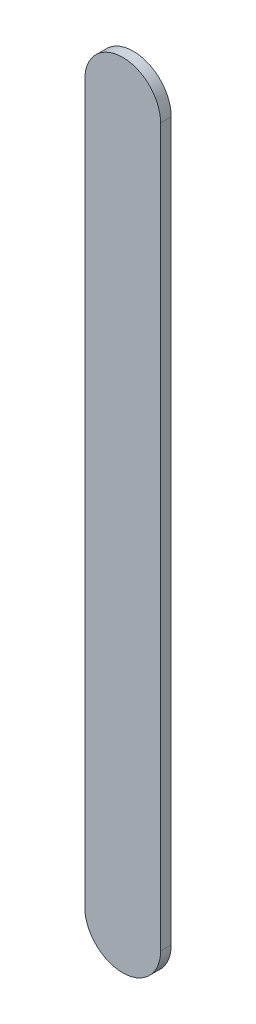
ISO-10303-21;
HEADER;
FILE_DESCRIPTION(('STEP AP214'),'2;1');
FILE_NAME('part.step','',(''),(''),'','','');
FILE_SCHEMA(('AUTOMOTIVE_DESIGN { 1 0 10303 214 1 1 1 1 }'));
ENDSEC;
DATA;
#1=APPLICATION_CONTEXT('core data for automotive mechanical design processes');
#2=APPLICATION_PROTOCOL_DEFINITION('international standard','automotive_design',2000,#1);
#3=PRODUCT_CONTEXT('',#1,'mechanical');
#4=PRODUCT('Part','Part','',(#3));
#5=PRODUCT_RELATED_PRODUCT_CATEGORY('part','',(#4));
#6=PRODUCT_DEFINITION_FORMATION('','',#4);
#7=PRODUCT_DEFINITION_CONTEXT('part definition',#1,'design');
#8=PRODUCT_DEFINITION('design','',#6,#7);
#9=PRODUCT_DEFINITION_SHAPE('','',#8);
#10=(LENGTH_UNIT() NAMED_UNIT(*) SI_UNIT(.MILLI.,.METRE.));
#11=(NAMED_UNIT(*) PLANE_ANGLE_UNIT() SI_UNIT($,.RADIAN.));
#12=(NAMED_UNIT(*) SI_UNIT($,.STERADIAN.) SOLID_ANGLE_UNIT());
#13=UNCERTAINTY_MEASURE_WITH_UNIT(LENGTH_MEASURE(1.E-05),#10,'distance_accuracy_value','');
#14=(GEOMETRIC_REPRESENTATION_CONTEXT(3) GLOBAL_UNCERTAINTY_ASSIGNED_CONTEXT((#13)) GLOBAL_UNIT_ASSIGNED_CONTEXT((#10,
#11,#12)) REPRESENTATION_CONTEXT('',''));
#15=CARTESIAN_POINT('',(0.,0.,0.));
#16=DIRECTION('',(0.,0.,1.));
#17=DIRECTION('',(1.,0.,0.));
#18=AXIS2_PLACEMENT_3D('',#15,#16,#17);
#19=CARTESIAN_POINT('',(87.4440212,97.68692426,0.));
#20=DIRECTION('',(-1.,0.,0.));
#21=DIRECTION('',(0.,1.,0.));
#22=AXIS2_PLACEMENT_3D('',#19,#20,#21);
#23=PLANE('',#22);
#24=DIRECTION('',(0.,1.,0.));
#25=VECTOR('',#24,1.);
#26=CARTESIAN_POINT('',(87.4440212,97.68692426,0.03556));
#27=LINE('',#26,#25);
#28=CARTESIAN_POINT('',(87.4440212,97.68692426,0.03556));
#29=VERTEX_POINT('',#28);
#30=CARTESIAN_POINT('',(87.4440212,100.0900208,0.03556));
#31=VERTEX_POINT('',#30);
#32=EDGE_CURVE('E11',#29,#31,#27,.T.);
#33=ORIENTED_EDGE('',*,*,#32,.F.);
#34=DIRECTION('',(0.,0.,1.));
#35=VECTOR('',#34,1.);
#36=CARTESIAN_POINT('',(87.4440212,97.68692426,0.));
#37=LINE('',#36,#35);
#38=CARTESIAN_POINT('',(87.4440212,97.68692426,0.));
#39=VERTEX_POINT('',#38);
#40=EDGE_CURVE('E24',#39,#29,#37,.T.);
#41=ORIENTED_EDGE('',*,*,#40,.F.);
#42=DIRECTION('',(0.,1.,0.));
#43=VECTOR('',#42,1.);
#44=CARTESIAN_POINT('',(87.4440212,97.68692426,0.));
#45=LINE('',#44,#43);
#46=CARTESIAN_POINT('',(87.4440212,100.0900208,0.));
#47=VERTEX_POINT('',#46);
#48=EDGE_CURVE('E75',#39,#47,#45,.T.);
#49=ORIENTED_EDGE('',*,*,#48,.T.);
#50=DIRECTION('',(0.,0.,1.));
#51=VECTOR('',#50,1.);
#52=CARTESIAN_POINT('',(87.4440212,100.0900208,0.));
#53=LINE('',#52,#51);
#54=EDGE_CURVE('E37',#47,#31,#53,.T.);
#55=ORIENTED_EDGE('',*,*,#54,.T.);
#56=EDGE_LOOP('',(#33,#41,#49,#55));
#57=FACE_BOUND('',#56,.T.);
#58=ADVANCED_FACE('F17',(#57),#23,.F.);
#59=CARTESIAN_POINT('',(87.3170212,100.0900208,0.));
#60=DIRECTION('',(0.,0.,-1.));
#61=DIRECTION('',(1.,1.11896493820492E-13,0.));
#62=AXIS2_PLACEMENT_3D('',#59,#60,#61);
#63=CYLINDRICAL_SURFACE('',#62,0.127000000000005);
#64=CARTESIAN_POINT('',(87.3170212,100.0900208,0.03556));
#65=DIRECTION('',(0.,0.,1.));
#66=DIRECTION('',(1.,1.11896493820492E-13,0.));
#67=AXIS2_PLACEMENT_3D('',#64,#65,#66);
#68=CIRCLE('',#67,0.127000000000005);
#69=CARTESIAN_POINT('',(87.1900212,100.0900208,0.03556));
#70=VERTEX_POINT('',#69);
#71=EDGE_CURVE('E83',#31,#70,#68,.T.);
#72=ORIENTED_EDGE('',*,*,#71,.F.);
#73=ORIENTED_EDGE('',*,*,#54,.F.);
#74=CARTESIAN_POINT('',(87.3170212,100.0900208,0.));
#75=DIRECTION('',(0.,0.,1.));
#76=DIRECTION('',(1.,1.11896493820492E-13,0.));
#77=AXIS2_PLACEMENT_3D('',#74,#75,#76);
#78=CIRCLE('',#77,0.127000000000005);
#79=CARTESIAN_POINT('',(87.1900212,100.0900208,0.));
#80=VERTEX_POINT('',#79);
#81=EDGE_CURVE('E81',#47,#80,#78,.T.);
#82=ORIENTED_EDGE('',*,*,#81,.T.);
#83=DIRECTION('',(0.,0.,1.));
#84=VECTOR('',#83,1.);
#85=CARTESIAN_POINT('',(87.1900212,100.0900208,0.));
#86=LINE('',#85,#84);
#87=EDGE_CURVE('E67',#80,#70,#86,.T.);
#88=ORIENTED_EDGE('',*,*,#87,.T.);
#89=EDGE_LOOP('',(#72,#73,#82,#88));
#90=FACE_BOUND('',#89,.T.);
#91=ADVANCED_FACE('F89',(#90),#63,.T.);
#92=CARTESIAN_POINT('',(87.1900212,100.0900208,0.));
#93=DIRECTION('',(1.,0.,0.));
#94=DIRECTION('',(0.,-1.,0.));
#95=AXIS2_PLACEMENT_3D('',#92,#93,#94);
#96=PLANE('',#95);
#97=DIRECTION('',(0.,-1.,0.));
#98=VECTOR('',#97,1.);
#99=CARTESIAN_POINT('',(87.1900212,100.0900208,0.03556));
#100=LINE('',#99,#98);
#101=CARTESIAN_POINT('',(87.1900212,97.68692426,0.03556));
#102=VERTEX_POINT('',#101);
#103=EDGE_CURVE('E71',#70,#102,#100,.T.);
#104=ORIENTED_EDGE('',*,*,#103,.F.);
#105=ORIENTED_EDGE('',*,*,#87,.F.);
#106=DIRECTION('',(0.,-1.,0.));
#107=VECTOR('',#106,1.);
#108=CARTESIAN_POINT('',(87.1900212,100.0900208,0.));
#109=LINE('',#108,#107);
#110=CARTESIAN_POINT('',(87.1900212,97.68692426,0.));
#111=VERTEX_POINT('',#110);
#112=EDGE_CURVE('E63',#80,#111,#109,.T.);
#113=ORIENTED_EDGE('',*,*,#112,.T.);
#114=DIRECTION('',(0.,0.,1.));
#115=VECTOR('',#114,1.);
#116=CARTESIAN_POINT('',(87.1900212,97.68692426,0.));
#117=LINE('',#116,#115);
#118=EDGE_CURVE('E53',#111,#102,#117,.T.);
#119=ORIENTED_EDGE('',*,*,#118,.T.);
#120=EDGE_LOOP('',(#104,#105,#113,#119));
#121=FACE_BOUND('',#120,.T.);
#122=ADVANCED_FACE('F66',(#121),#96,.F.);
#123=CARTESIAN_POINT('',(87.3170212,97.68692426,0.));
#124=DIRECTION('',(0.,0.,-1.));
#125=DIRECTION('',(-1.,-1.1189649382048E-13,0.));
#126=AXIS2_PLACEMENT_3D('',#123,#124,#125);
#127=CYLINDRICAL_SURFACE('',#126,0.127000000000005);
#128=CARTESIAN_POINT('',(87.3170212,97.68692426,0.03556));
#129=DIRECTION('',(0.,0.,1.));
#130=DIRECTION('',(-1.,-1.1189649382048E-13,0.));
#131=AXIS2_PLACEMENT_3D('',#128,#129,#130);
#132=CIRCLE('',#131,0.127000000000005);
#133=EDGE_CURVE('E59',#102,#29,#132,.T.);
#134=ORIENTED_EDGE('',*,*,#133,.F.);
#135=ORIENTED_EDGE('',*,*,#118,.F.);
#136=CARTESIAN_POINT('',(87.3170212,97.68692426,0.));
#137=DIRECTION('',(0.,0.,1.));
#138=DIRECTION('',(-1.,-1.1189649382048E-13,0.));
#139=AXIS2_PLACEMENT_3D('',#136,#137,#138);
#140=CIRCLE('',#139,0.127000000000005);
#141=EDGE_CURVE('E57',#111,#39,#140,.T.);
#142=ORIENTED_EDGE('',*,*,#141,.T.);
#143=ORIENTED_EDGE('',*,*,#40,.T.);
#144=EDGE_LOOP('',(#134,#135,#142,#143));
#145=FACE_BOUND('',#144,.T.);
#146=ADVANCED_FACE('F55',(#145),#127,.T.);
#147=CARTESIAN_POINT('',(87.4440212,97.68692426,0.));
#148=DIRECTION('',(0.,0.,-1.));
#149=DIRECTION('',(-1.,0.,0.));
#150=AXIS2_PLACEMENT_3D('',#147,#148,#149);
#151=PLANE('',#150);
#152=ORIENTED_EDGE('',*,*,#141,.F.);
#153=ORIENTED_EDGE('',*,*,#112,.F.);
#154=ORIENTED_EDGE('',*,*,#81,.F.);
#155=ORIENTED_EDGE('',*,*,#48,.F.);
#156=EDGE_LOOP('',(#152,#153,#154,#155));
#157=FACE_BOUND('',#156,.T.);
#158=ADVANCED_FACE('F74',(#157),#151,.T.);
#159=CARTESIAN_POINT('',(87.4440212,97.68692426,0.03556));
#160=DIRECTION('',(0.,0.,-1.));
#161=DIRECTION('',(-1.,0.,0.));
#162=AXIS2_PLACEMENT_3D('',#159,#160,#161);
#163=PLANE('',#162);
#164=ORIENTED_EDGE('',*,*,#32,.T.);
#165=ORIENTED_EDGE('',*,*,#71,.T.);
#166=ORIENTED_EDGE('',*,*,#103,.T.);
#167=ORIENTED_EDGE('',*,*,#133,.T.);
#168=EDGE_LOOP('',(#164,#165,#166,#167));
#169=FACE_BOUND('',#168,.T.);
#170=ADVANCED_FACE('F91',(#169),#163,.F.);
#171=CLOSED_SHELL('',(#58,#91,#122,#146,#158,#170));
#172=MANIFOLD_SOLID_BREP('B1',#171);
#173=ADVANCED_BREP_SHAPE_REPRESENTATION('',(#18,#172),#14);
#174=SHAPE_DEFINITION_REPRESENTATION(#9,#173);
ENDSEC;
END-ISO-10303-21;
